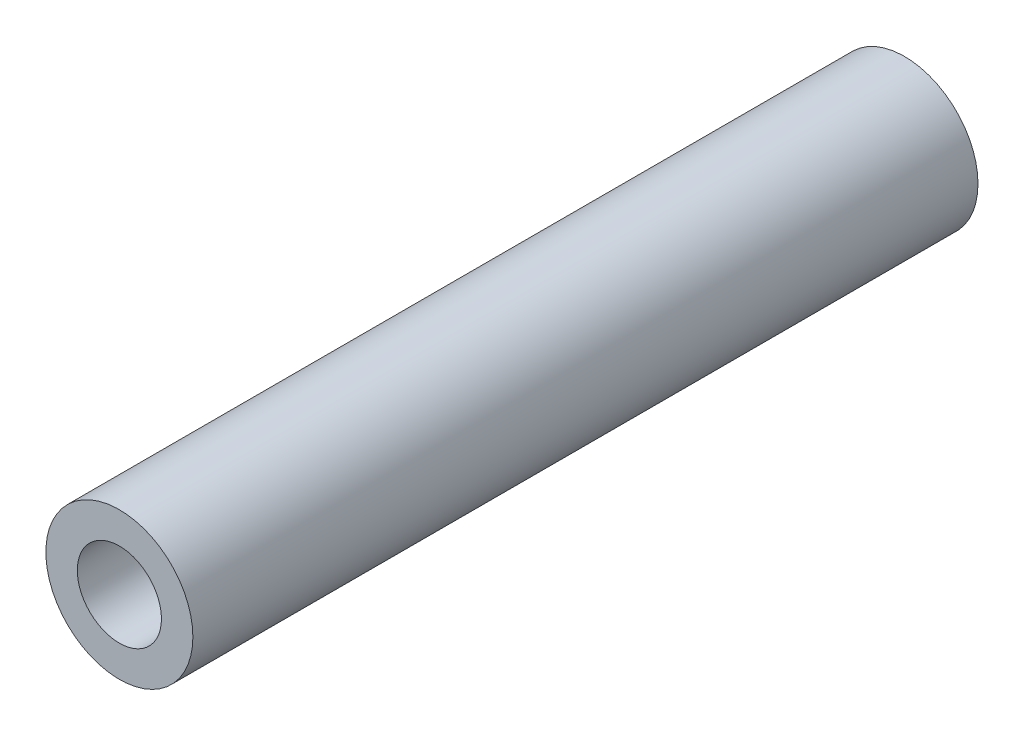
ISO-10303-21;
HEADER;
FILE_DESCRIPTION(('STEP AP214'),'2;1');
FILE_NAME('part.step','',(''),(''),'','','');
FILE_SCHEMA(('AUTOMOTIVE_DESIGN { 1 0 10303 214 1 1 1 1 }'));
ENDSEC;
DATA;
#1=APPLICATION_CONTEXT('core data for automotive mechanical design processes');
#2=APPLICATION_PROTOCOL_DEFINITION('international standard','automotive_design',2000,#1);
#3=PRODUCT_CONTEXT('',#1,'mechanical');
#4=PRODUCT('Part','Part','',(#3));
#5=PRODUCT_RELATED_PRODUCT_CATEGORY('part','',(#4));
#6=PRODUCT_DEFINITION_FORMATION('','',#4);
#7=PRODUCT_DEFINITION_CONTEXT('part definition',#1,'design');
#8=PRODUCT_DEFINITION('design','',#6,#7);
#9=PRODUCT_DEFINITION_SHAPE('','',#8);
#10=(LENGTH_UNIT() NAMED_UNIT(*) SI_UNIT(.MILLI.,.METRE.));
#11=(NAMED_UNIT(*) PLANE_ANGLE_UNIT() SI_UNIT($,.RADIAN.));
#12=(NAMED_UNIT(*) SI_UNIT($,.STERADIAN.) SOLID_ANGLE_UNIT());
#13=UNCERTAINTY_MEASURE_WITH_UNIT(LENGTH_MEASURE(1.E-05),#10,'distance_accuracy_value','');
#14=(GEOMETRIC_REPRESENTATION_CONTEXT(3) GLOBAL_UNCERTAINTY_ASSIGNED_CONTEXT((#13)) GLOBAL_UNIT_ASSIGNED_CONTEXT((#10,
#11,#12)) REPRESENTATION_CONTEXT('',''));
#15=CARTESIAN_POINT('',(0.,0.,0.));
#16=DIRECTION('',(0.,0.,1.));
#17=DIRECTION('',(1.,0.,0.));
#18=AXIS2_PLACEMENT_3D('',#15,#16,#17);
#19=CARTESIAN_POINT('',(1803.9911735505,-1743.84940911594,78.8956175875772));
#20=DIRECTION('',(0.,0.,-1.));
#21=DIRECTION('',(-1.,0.,0.));
#22=AXIS2_PLACEMENT_3D('',#19,#20,#21);
#23=CYLINDRICAL_SURFACE('',#22,4.63000000000001);
#24=CARTESIAN_POINT('',(1803.9911735505,-1743.84940911594,16.3499999999429));
#25=DIRECTION('',(0.,0.,1.));
#26=DIRECTION('',(1.,0.,0.));
#27=AXIS2_PLACEMENT_3D('',#24,#25,#26);
#28=CIRCLE('',#27,4.63000000000001);
#29=CARTESIAN_POINT('',(1808.6211735505,-1743.84940911594,16.3499999999429));
#30=VERTEX_POINT('',#29);
#31=EDGE_CURVE('E37',#30,#30,#28,.T.);
#32=ORIENTED_EDGE('',*,*,#31,.T.);
#33=EDGE_LOOP('',(#32));
#34=FACE_BOUND('',#33,.T.);
#35=CARTESIAN_POINT('',(1803.9911735505,-1743.84940911594,65.8000000000026));
#36=DIRECTION('',(0.,0.,1.));
#37=DIRECTION('',(1.,0.,0.));
#38=AXIS2_PLACEMENT_3D('',#35,#36,#37);
#39=CIRCLE('',#38,4.63000000000001);
#40=CARTESIAN_POINT('',(1808.6211735505,-1743.84940911594,65.8000000000026));
#41=VERTEX_POINT('',#40);
#42=EDGE_CURVE('E10',#41,#41,#39,.T.);
#43=ORIENTED_EDGE('',*,*,#42,.F.);
#44=EDGE_LOOP('',(#43));
#45=FACE_BOUND('',#44,.T.);
#46=ADVANCED_FACE('F30',(#34,#45),#23,.T.);
#47=CARTESIAN_POINT('',(1803.9911735505,-1743.84940911594,16.3499999999429));
#48=DIRECTION('',(0.,0.,1.));
#49=DIRECTION('',(1.,0.,0.));
#50=AXIS2_PLACEMENT_3D('',#47,#48,#49);
#51=PLANE('',#50);
#52=ORIENTED_EDGE('',*,*,#31,.F.);
#53=EDGE_LOOP('',(#52));
#54=FACE_BOUND('',#53,.T.);
#55=CARTESIAN_POINT('',(1803.9911735505,-1743.84940911594,16.3499999999429));
#56=DIRECTION('',(0.,0.,1.));
#57=DIRECTION('',(1.,0.,0.));
#58=AXIS2_PLACEMENT_3D('',#55,#56,#57);
#59=CIRCLE('',#58,2.6500000000001);
#60=CARTESIAN_POINT('',(1806.6411735505,-1743.84940911594,16.3499999999429));
#61=VERTEX_POINT('',#60);
#62=EDGE_CURVE('E42',#61,#61,#59,.T.);
#63=ORIENTED_EDGE('',*,*,#62,.T.);
#64=EDGE_LOOP('',(#63));
#65=FACE_BOUND('',#64,.T.);
#66=ADVANCED_FACE('F58',(#54,#65),#51,.F.);
#67=CARTESIAN_POINT('',(1803.9911735505,-1743.84940911594,78.8956175875772));
#68=DIRECTION('',(0.,0.,-1.));
#69=DIRECTION('',(-1.,0.,0.));
#70=AXIS2_PLACEMENT_3D('',#67,#68,#69);
#71=CYLINDRICAL_SURFACE('',#70,2.6500000000001);
#72=ORIENTED_EDGE('',*,*,#62,.F.);
#73=EDGE_LOOP('',(#72));
#74=FACE_BOUND('',#73,.T.);
#75=CARTESIAN_POINT('',(1803.9911735505,-1743.84940911594,65.8000000000026));
#76=DIRECTION('',(0.,0.,1.));
#77=DIRECTION('',(1.,0.,0.));
#78=AXIS2_PLACEMENT_3D('',#75,#76,#77);
#79=CIRCLE('',#78,2.6500000000001);
#80=CARTESIAN_POINT('',(1806.6411735505,-1743.84940911594,65.8000000000026));
#81=VERTEX_POINT('',#80);
#82=EDGE_CURVE('E33',#81,#81,#79,.T.);
#83=ORIENTED_EDGE('',*,*,#82,.T.);
#84=EDGE_LOOP('',(#83));
#85=FACE_BOUND('',#84,.T.);
#86=ADVANCED_FACE('F50',(#74,#85),#71,.F.);
#87=CARTESIAN_POINT('',(1806.28336941063,-1743.60519990485,65.8000000000026));
#88=DIRECTION('',(0.,0.,1.));
#89=DIRECTION('',(-0.628216763509586,-0.778038365407222,0.));
#90=AXIS2_PLACEMENT_3D('',#87,#88,#89);
#91=PLANE('',#90);
#92=ORIENTED_EDGE('',*,*,#82,.F.);
#93=EDGE_LOOP('',(#92));
#94=FACE_BOUND('',#93,.T.);
#95=ORIENTED_EDGE('',*,*,#42,.T.);
#96=EDGE_LOOP('',(#95));
#97=FACE_BOUND('',#96,.T.);
#98=ADVANCED_FACE('F52',(#94,#97),#91,.T.);
#99=CLOSED_SHELL('',(#46,#66,#86,#98));
#100=MANIFOLD_SOLID_BREP('B2',#99);
#101=ADVANCED_BREP_SHAPE_REPRESENTATION('',(#18,#100),#14);
#102=SHAPE_DEFINITION_REPRESENTATION(#9,#101);
ENDSEC;
END-ISO-10303-21;
